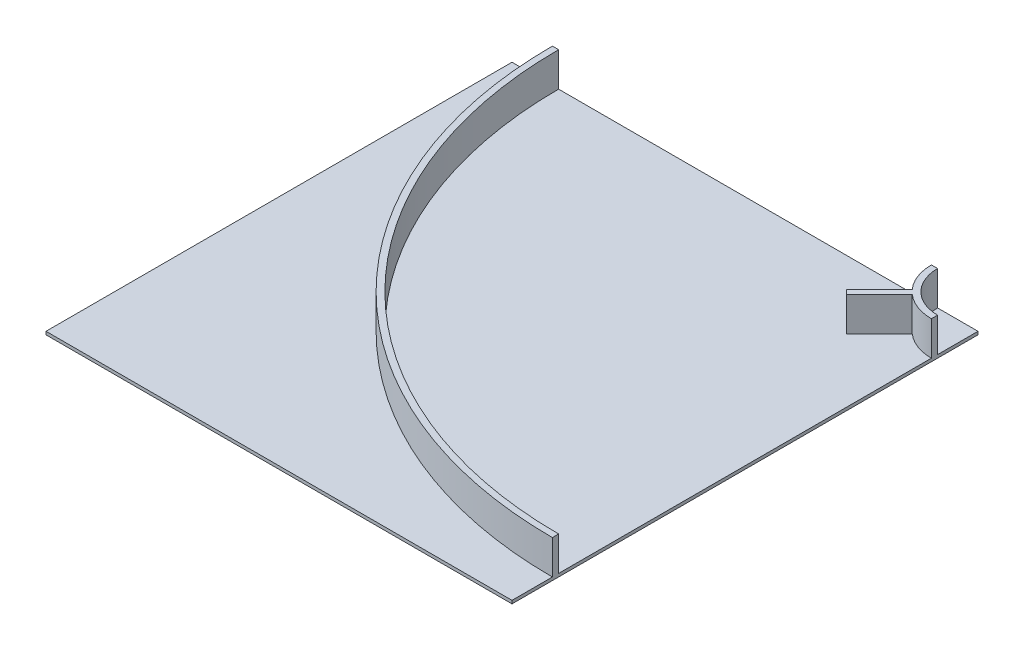
ISO-10303-21;
HEADER;
FILE_DESCRIPTION(('STEP AP214'),'2;1');
FILE_NAME('part.step','',(''),(''),'','','');
FILE_SCHEMA(('AUTOMOTIVE_DESIGN { 1 0 10303 214 1 1 1 1 }'));
ENDSEC;
DATA;
#1=APPLICATION_CONTEXT('core data for automotive mechanical design processes');
#2=APPLICATION_PROTOCOL_DEFINITION('international standard','automotive_design',2000,#1);
#3=PRODUCT_CONTEXT('',#1,'mechanical');
#4=PRODUCT('Part','Part','',(#3));
#5=PRODUCT_RELATED_PRODUCT_CATEGORY('part','',(#4));
#6=PRODUCT_DEFINITION_FORMATION('','',#4);
#7=PRODUCT_DEFINITION_CONTEXT('part definition',#1,'design');
#8=PRODUCT_DEFINITION('design','',#6,#7);
#9=PRODUCT_DEFINITION_SHAPE('','',#8);
#10=(LENGTH_UNIT() NAMED_UNIT(*) SI_UNIT(.MILLI.,.METRE.));
#11=(NAMED_UNIT(*) PLANE_ANGLE_UNIT() SI_UNIT($,.RADIAN.));
#12=(NAMED_UNIT(*) SI_UNIT($,.STERADIAN.) SOLID_ANGLE_UNIT());
#13=UNCERTAINTY_MEASURE_WITH_UNIT(LENGTH_MEASURE(1.E-05),#10,'distance_accuracy_value','');
#14=(GEOMETRIC_REPRESENTATION_CONTEXT(3) GLOBAL_UNCERTAINTY_ASSIGNED_CONTEXT((#13)) GLOBAL_UNIT_ASSIGNED_CONTEXT((#10,
#11,#12)) REPRESENTATION_CONTEXT('',''));
#15=CARTESIAN_POINT('',(0.,0.,0.));
#16=DIRECTION('',(0.,0.,1.));
#17=DIRECTION('',(1.,0.,0.));
#18=AXIS2_PLACEMENT_3D('',#15,#16,#17);
#19=CARTESIAN_POINT('',(0.,10.,0.));
#20=DIRECTION('',(0.,1.,0.));
#21=DIRECTION('',(0.,0.,1.));
#22=AXIS2_PLACEMENT_3D('',#19,#20,#21);
#23=PLANE('',#22);
#24=CARTESIAN_POINT('',(750.,10.,-750.));
#25=DIRECTION('',(0.,1.,0.));
#26=DIRECTION('',(0.,0.,1.));
#27=AXIS2_PLACEMENT_3D('',#24,#25,#26);
#28=CIRCLE('',#27,150.);
#29=CARTESIAN_POINT('',(651.241015369282,10.,-637.098879745551));
#30=VERTEX_POINT('',#29);
#31=CARTESIAN_POINT('',(750.,10.,-600.));
#32=VERTEX_POINT('',#31);
#33=EDGE_CURVE('E213',#30,#32,#28,.T.);
#34=ORIENTED_EDGE('',*,*,#33,.F.);
#35=DIRECTION('',(0.707106781186546,0.,-0.707106781186549));
#36=VECTOR('',#35,1.);
#37=CARTESIAN_POINT('',(545.1749981913,10.,-531.032862567569));
#38=LINE('',#37,#36);
#39=CARTESIAN_POINT('',(545.1749981913,10.,-531.032862567569));
#40=VERTEX_POINT('',#39);
#41=EDGE_CURVE('E352',#40,#30,#38,.T.);
#42=ORIENTED_EDGE('',*,*,#41,.F.);
#43=DIRECTION('',(0.707106781186547,0.,0.707106781186547));
#44=VECTOR('',#43,1.);
#45=CARTESIAN_POINT('',(545.1749981913,10.,-531.032862567569));
#46=LINE('',#45,#44);
#47=CARTESIAN_POINT('',(531.032862567568,10.,-545.1749981913));
#48=VERTEX_POINT('',#47);
#49=EDGE_CURVE('E364',#48,#40,#46,.T.);
#50=ORIENTED_EDGE('',*,*,#49,.F.);
#51=DIRECTION('',(-0.707106781186548,0.,0.707106781186547));
#52=VECTOR('',#51,1.);
#53=CARTESIAN_POINT('',(531.032862567568,10.,-545.1749981913));
#54=LINE('',#53,#52);
#55=CARTESIAN_POINT('',(637.098879745551,10.,-651.241015369282));
#56=VERTEX_POINT('',#55);
#57=EDGE_CURVE('E187',#56,#48,#54,.T.);
#58=ORIENTED_EDGE('',*,*,#57,.F.);
#59=CARTESIAN_POINT('',(600.,10.,-750.));
#60=VERTEX_POINT('',#59);
#61=EDGE_CURVE('E196',#60,#56,#28,.T.);
#62=ORIENTED_EDGE('',*,*,#61,.F.);
#63=DIRECTION('',(-1.,0.,0.));
#64=VECTOR('',#63,1.);
#65=CARTESIAN_POINT('',(-750.,10.,-750.));
#66=LINE('',#65,#64);
#67=CARTESIAN_POINT('',(-600.,10.,-750.));
#68=VERTEX_POINT('',#67);
#69=EDGE_CURVE('E269',#60,#68,#66,.T.);
#70=ORIENTED_EDGE('',*,*,#69,.T.);
#71=CARTESIAN_POINT('',(750.,10.,-750.));
#72=DIRECTION('',(0.,1.,0.));
#73=DIRECTION('',(0.,0.,1.));
#74=AXIS2_PLACEMENT_3D('',#71,#72,#73);
#75=CIRCLE('',#74,1350.);
#76=CARTESIAN_POINT('',(750.,10.,599.999999999999));
#77=VERTEX_POINT('',#76);
#78=EDGE_CURVE('E231',#68,#77,#75,.T.);
#79=ORIENTED_EDGE('',*,*,#78,.T.);
#80=DIRECTION('',(0.,0.,-1.));
#81=VECTOR('',#80,1.);
#82=CARTESIAN_POINT('',(750.,10.,-750.));
#83=LINE('',#82,#81);
#84=EDGE_CURVE('E279',#77,#32,#83,.T.);
#85=ORIENTED_EDGE('',*,*,#84,.T.);
#86=EDGE_LOOP('',(#34,#42,#50,#58,#62,#70,#79,#85));
#87=FACE_BOUND('',#86,.T.);
#88=ADVANCED_FACE('F62',(#87),#23,.T.);
#89=CARTESIAN_POINT('',(750.,120.,-750.));
#90=DIRECTION('',(0.,-1.,0.));
#91=DIRECTION('',(0.,0.,-1.));
#92=AXIS2_PLACEMENT_3D('',#89,#90,#91);
#93=CYLINDRICAL_SURFACE('',#92,150.);
#94=DIRECTION('',(0.,-1.,0.));
#95=VECTOR('',#94,1.);
#96=CARTESIAN_POINT('',(651.241015369282,290.,-637.098879745551));
#97=LINE('',#96,#95);
#98=CARTESIAN_POINT('',(651.241015369283,120.,-637.09887974555));
#99=VERTEX_POINT('',#98);
#100=EDGE_CURVE('E197',#99,#30,#97,.T.);
#101=ORIENTED_EDGE('',*,*,#100,.T.);
#102=ORIENTED_EDGE('',*,*,#33,.T.);
#103=DIRECTION('',(0.,-1.,0.));
#104=VECTOR('',#103,1.);
#105=CARTESIAN_POINT('',(750.,120.,-600.));
#106=LINE('',#105,#104);
#107=CARTESIAN_POINT('',(750.,120.,-600.));
#108=VERTEX_POINT('',#107);
#109=EDGE_CURVE('E218',#108,#32,#106,.T.);
#110=ORIENTED_EDGE('',*,*,#109,.F.);
#111=CARTESIAN_POINT('',(750.,120.,-750.));
#112=DIRECTION('',(0.,1.,0.));
#113=DIRECTION('',(0.,0.,1.));
#114=AXIS2_PLACEMENT_3D('',#111,#112,#113);
#115=CIRCLE('',#114,150.);
#116=EDGE_CURVE('E205',#99,#108,#115,.T.);
#117=ORIENTED_EDGE('',*,*,#116,.F.);
#118=EDGE_LOOP('',(#101,#102,#110,#117));
#119=FACE_BOUND('',#118,.T.);
#120=ADVANCED_FACE('F338',(#119),#93,.T.);
#121=DIRECTION('',(0.,-1.,0.));
#122=VECTOR('',#121,1.);
#123=CARTESIAN_POINT('',(637.098879745551,290.,-651.241015369282));
#124=LINE('',#123,#122);
#125=CARTESIAN_POINT('',(637.098879745551,120.,-651.241015369282));
#126=VERTEX_POINT('',#125);
#127=EDGE_CURVE('E181',#126,#56,#124,.T.);
#128=ORIENTED_EDGE('',*,*,#127,.F.);
#129=CARTESIAN_POINT('',(600.,120.,-750.));
#130=VERTEX_POINT('',#129);
#131=EDGE_CURVE('E194',#130,#126,#115,.T.);
#132=ORIENTED_EDGE('',*,*,#131,.F.);
#133=DIRECTION('',(0.,-1.,0.));
#134=VECTOR('',#133,1.);
#135=CARTESIAN_POINT('',(600.,120.,-750.));
#136=LINE('',#135,#134);
#137=EDGE_CURVE('E221',#130,#60,#136,.T.);
#138=ORIENTED_EDGE('',*,*,#137,.T.);
#139=ORIENTED_EDGE('',*,*,#61,.T.);
#140=EDGE_LOOP('',(#128,#132,#138,#139));
#141=FACE_BOUND('',#140,.T.);
#142=ADVANCED_FACE('F192',(#141),#93,.T.);
#143=CARTESIAN_POINT('',(750.,10.,-750.));
#144=DIRECTION('',(0.,1.,0.));
#145=DIRECTION('',(0.,0.,1.));
#146=AXIS2_PLACEMENT_3D('',#143,#144,#145);
#147=CIRCLE('',#146,130.);
#148=CARTESIAN_POINT('',(620.,10.,-750.));
#149=VERTEX_POINT('',#148);
#150=CARTESIAN_POINT('',(750.,10.,-620.));
#151=VERTEX_POINT('',#150);
#152=EDGE_CURVE('E88',#149,#151,#147,.T.);
#153=ORIENTED_EDGE('',*,*,#152,.T.);
#154=CARTESIAN_POINT('',(750.,10.,-750.));
#155=VERTEX_POINT('',#154);
#156=EDGE_CURVE('E66',#151,#155,#83,.T.);
#157=ORIENTED_EDGE('',*,*,#156,.T.);
#158=EDGE_CURVE('E270',#155,#149,#66,.T.);
#159=ORIENTED_EDGE('',*,*,#158,.T.);
#160=EDGE_LOOP('',(#153,#157,#159));
#161=FACE_BOUND('',#160,.T.);
#162=ADVANCED_FACE('F331',(#161),#23,.T.);
#163=CARTESIAN_POINT('',(750.,10.,-750.));
#164=DIRECTION('',(-1.,0.,0.));
#165=DIRECTION('',(0.,0.,1.));
#166=AXIS2_PLACEMENT_3D('',#163,#164,#165);
#167=PLANE('',#166);
#168=DIRECTION('',(0.,0.,-1.));
#169=VECTOR('',#168,1.);
#170=CARTESIAN_POINT('',(750.,0.,-750.));
#171=LINE('',#170,#169);
#172=CARTESIAN_POINT('',(750.,0.,750.));
#173=VERTEX_POINT('',#172);
#174=CARTESIAN_POINT('',(750.,0.,-750.));
#175=VERTEX_POINT('',#174);
#176=EDGE_CURVE('E258',#173,#175,#171,.T.);
#177=ORIENTED_EDGE('',*,*,#176,.T.);
#178=DIRECTION('',(0.,-1.,0.));
#179=VECTOR('',#178,1.);
#180=CARTESIAN_POINT('',(750.,10.,-750.));
#181=LINE('',#180,#179);
#182=EDGE_CURVE('E12',#155,#175,#181,.T.);
#183=ORIENTED_EDGE('',*,*,#182,.F.);
#184=ORIENTED_EDGE('',*,*,#156,.F.);
#185=DIRECTION('',(0.,-1.,0.));
#186=VECTOR('',#185,1.);
#187=CARTESIAN_POINT('',(750.,120.,-620.));
#188=LINE('',#187,#186);
#189=CARTESIAN_POINT('',(750.,120.,-620.));
#190=VERTEX_POINT('',#189);
#191=EDGE_CURVE('E207',#190,#151,#188,.T.);
#192=ORIENTED_EDGE('',*,*,#191,.F.);
#193=DIRECTION('',(0.,0.,-1.));
#194=VECTOR('',#193,1.);
#195=CARTESIAN_POINT('',(750.,120.,-1.11022302462516E-13));
#196=LINE('',#195,#194);
#197=EDGE_CURVE('E204',#108,#190,#196,.T.);
#198=ORIENTED_EDGE('',*,*,#197,.F.);
#199=ORIENTED_EDGE('',*,*,#109,.T.);
#200=ORIENTED_EDGE('',*,*,#84,.F.);
#201=DIRECTION('',(0.,-1.,0.));
#202=VECTOR('',#201,1.);
#203=CARTESIAN_POINT('',(750.,120.,599.999999999999));
#204=LINE('',#203,#202);
#205=CARTESIAN_POINT('',(750.,120.,599.999999999999));
#206=VERTEX_POINT('',#205);
#207=EDGE_CURVE('E253',#206,#77,#204,.T.);
#208=ORIENTED_EDGE('',*,*,#207,.F.);
#209=DIRECTION('',(0.,0.,-1.));
#210=VECTOR('',#209,1.);
#211=CARTESIAN_POINT('',(750.,120.,-1.11022302462516E-13));
#212=LINE('',#211,#210);
#213=CARTESIAN_POINT('',(750.,120.,620.));
#214=VERTEX_POINT('',#213);
#215=EDGE_CURVE('E233',#214,#206,#212,.T.);
#216=ORIENTED_EDGE('',*,*,#215,.F.);
#217=DIRECTION('',(0.,-1.,0.));
#218=VECTOR('',#217,1.);
#219=CARTESIAN_POINT('',(750.,120.,620.));
#220=LINE('',#219,#218);
#221=CARTESIAN_POINT('',(750.,10.,620.));
#222=VERTEX_POINT('',#221);
#223=EDGE_CURVE('E249',#214,#222,#220,.T.);
#224=ORIENTED_EDGE('',*,*,#223,.T.);
#225=CARTESIAN_POINT('',(750.,10.,750.));
#226=VERTEX_POINT('',#225);
#227=EDGE_CURVE('E282',#226,#222,#83,.T.);
#228=ORIENTED_EDGE('',*,*,#227,.F.);
#229=DIRECTION('',(0.,-1.,0.));
#230=VECTOR('',#229,1.);
#231=CARTESIAN_POINT('',(750.,10.,750.));
#232=LINE('',#231,#230);
#233=EDGE_CURVE('E289',#226,#173,#232,.T.);
#234=ORIENTED_EDGE('',*,*,#233,.T.);
#235=EDGE_LOOP('',(#177,#183,#184,#192,#198,#199,#200,#208,#216,#224,#228,#234));
#236=FACE_BOUND('',#235,.T.);
#237=ADVANCED_FACE('F64',(#236),#167,.F.);
#238=CARTESIAN_POINT('',(-750.,10.,-750.));
#239=DIRECTION('',(0.,0.,1.));
#240=DIRECTION('',(1.,0.,0.));
#241=AXIS2_PLACEMENT_3D('',#238,#239,#240);
#242=PLANE('',#241);
#243=DIRECTION('',(-1.,0.,0.));
#244=VECTOR('',#243,1.);
#245=CARTESIAN_POINT('',(-750.,0.,-750.));
#246=LINE('',#245,#244);
#247=CARTESIAN_POINT('',(-750.,0.,-750.));
#248=VERTEX_POINT('',#247);
#249=EDGE_CURVE('E297',#175,#248,#246,.T.);
#250=ORIENTED_EDGE('',*,*,#249,.T.);
#251=DIRECTION('',(0.,-1.,0.));
#252=VECTOR('',#251,1.);
#253=CARTESIAN_POINT('',(-750.,10.,-750.));
#254=LINE('',#253,#252);
#255=CARTESIAN_POINT('',(-750.,10.,-750.));
#256=VERTEX_POINT('',#255);
#257=EDGE_CURVE('E72',#256,#248,#254,.T.);
#258=ORIENTED_EDGE('',*,*,#257,.F.);
#259=CARTESIAN_POINT('',(-620.,10.,-750.));
#260=VERTEX_POINT('',#259);
#261=EDGE_CURVE('E246',#260,#256,#66,.T.);
#262=ORIENTED_EDGE('',*,*,#261,.F.);
#263=DIRECTION('',(0.,-1.,0.));
#264=VECTOR('',#263,1.);
#265=CARTESIAN_POINT('',(-620.,120.,-750.));
#266=LINE('',#265,#264);
#267=CARTESIAN_POINT('',(-620.,120.,-750.));
#268=VERTEX_POINT('',#267);
#269=EDGE_CURVE('E252',#268,#260,#266,.T.);
#270=ORIENTED_EDGE('',*,*,#269,.F.);
#271=DIRECTION('',(-1.,0.,0.));
#272=VECTOR('',#271,1.);
#273=CARTESIAN_POINT('',(0.,120.,-750.));
#274=LINE('',#273,#272);
#275=CARTESIAN_POINT('',(-600.,120.,-750.));
#276=VERTEX_POINT('',#275);
#277=EDGE_CURVE('E227',#276,#268,#274,.T.);
#278=ORIENTED_EDGE('',*,*,#277,.F.);
#279=DIRECTION('',(0.,-1.,0.));
#280=VECTOR('',#279,1.);
#281=CARTESIAN_POINT('',(-600.,120.,-750.));
#282=LINE('',#281,#280);
#283=EDGE_CURVE('E238',#276,#68,#282,.T.);
#284=ORIENTED_EDGE('',*,*,#283,.T.);
#285=ORIENTED_EDGE('',*,*,#69,.F.);
#286=ORIENTED_EDGE('',*,*,#137,.F.);
#287=DIRECTION('',(-1.,0.,0.));
#288=VECTOR('',#287,1.);
#289=CARTESIAN_POINT('',(0.,120.,-750.));
#290=LINE('',#289,#288);
#291=CARTESIAN_POINT('',(620.,120.,-750.));
#292=VERTEX_POINT('',#291);
#293=EDGE_CURVE('E202',#292,#130,#290,.T.);
#294=ORIENTED_EDGE('',*,*,#293,.F.);
#295=DIRECTION('',(0.,-1.,0.));
#296=VECTOR('',#295,1.);
#297=CARTESIAN_POINT('',(620.,120.,-750.));
#298=LINE('',#297,#296);
#299=EDGE_CURVE('E223',#292,#149,#298,.T.);
#300=ORIENTED_EDGE('',*,*,#299,.T.);
#301=ORIENTED_EDGE('',*,*,#158,.F.);
#302=ORIENTED_EDGE('',*,*,#182,.T.);
#303=EDGE_LOOP('',(#250,#258,#262,#270,#278,#284,#285,#286,#294,#300,#301,#302));
#304=FACE_BOUND('',#303,.T.);
#305=ADVANCED_FACE('F324',(#304),#242,.F.);
#306=CARTESIAN_POINT('',(-750.,10.,-750.));
#307=DIRECTION('',(1.,0.,0.));
#308=DIRECTION('',(0.,0.,-1.));
#309=AXIS2_PLACEMENT_3D('',#306,#307,#308);
#310=PLANE('',#309);
#311=DIRECTION('',(0.,0.,1.));
#312=VECTOR('',#311,1.);
#313=CARTESIAN_POINT('',(-750.,0.,-750.));
#314=LINE('',#313,#312);
#315=CARTESIAN_POINT('',(-750.,0.,750.));
#316=VERTEX_POINT('',#315);
#317=EDGE_CURVE('E295',#248,#316,#314,.T.);
#318=ORIENTED_EDGE('',*,*,#317,.T.);
#319=DIRECTION('',(0.,-1.,0.));
#320=VECTOR('',#319,1.);
#321=CARTESIAN_POINT('',(-750.,10.,750.));
#322=LINE('',#321,#320);
#323=CARTESIAN_POINT('',(-750.,10.,750.));
#324=VERTEX_POINT('',#323);
#325=EDGE_CURVE('E286',#324,#316,#322,.T.);
#326=ORIENTED_EDGE('',*,*,#325,.F.);
#327=DIRECTION('',(0.,0.,1.));
#328=VECTOR('',#327,1.);
#329=CARTESIAN_POINT('',(-750.,10.,-750.));
#330=LINE('',#329,#328);
#331=EDGE_CURVE('E274',#256,#324,#330,.T.);
#332=ORIENTED_EDGE('',*,*,#331,.F.);
#333=ORIENTED_EDGE('',*,*,#257,.T.);
#334=EDGE_LOOP('',(#318,#326,#332,#333));
#335=FACE_BOUND('',#334,.T.);
#336=ADVANCED_FACE('F309',(#335),#310,.F.);
#337=CARTESIAN_POINT('',(-750.,10.,750.));
#338=DIRECTION('',(0.,0.,-1.));
#339=DIRECTION('',(-1.,0.,0.));
#340=AXIS2_PLACEMENT_3D('',#337,#338,#339);
#341=PLANE('',#340);
#342=DIRECTION('',(1.,0.,0.));
#343=VECTOR('',#342,1.);
#344=CARTESIAN_POINT('',(-750.,0.,750.));
#345=LINE('',#344,#343);
#346=EDGE_CURVE('E293',#316,#173,#345,.T.);
#347=ORIENTED_EDGE('',*,*,#346,.T.);
#348=ORIENTED_EDGE('',*,*,#233,.F.);
#349=DIRECTION('',(1.,0.,0.));
#350=VECTOR('',#349,1.);
#351=CARTESIAN_POINT('',(-750.,10.,750.));
#352=LINE('',#351,#350);
#353=EDGE_CURVE('E292',#324,#226,#352,.T.);
#354=ORIENTED_EDGE('',*,*,#353,.F.);
#355=ORIENTED_EDGE('',*,*,#325,.T.);
#356=EDGE_LOOP('',(#347,#348,#354,#355));
#357=FACE_BOUND('',#356,.T.);
#358=ADVANCED_FACE('F313',(#357),#341,.F.);
#359=CARTESIAN_POINT('',(750.,10.,-750.));
#360=DIRECTION('',(0.,1.,0.));
#361=DIRECTION('',(0.,0.,1.));
#362=AXIS2_PLACEMENT_3D('',#359,#360,#361);
#363=CIRCLE('',#362,1370.);
#364=EDGE_CURVE('E226',#260,#222,#363,.T.);
#365=ORIENTED_EDGE('',*,*,#364,.F.);
#366=ORIENTED_EDGE('',*,*,#261,.T.);
#367=ORIENTED_EDGE('',*,*,#331,.T.);
#368=ORIENTED_EDGE('',*,*,#353,.T.);
#369=ORIENTED_EDGE('',*,*,#227,.T.);
#370=EDGE_LOOP('',(#365,#366,#367,#368,#369));
#371=FACE_BOUND('',#370,.T.);
#372=ADVANCED_FACE('F305',(#371),#23,.T.);
#373=CARTESIAN_POINT('',(0.,0.,0.));
#374=DIRECTION('',(0.,1.,0.));
#375=DIRECTION('',(0.,0.,1.));
#376=AXIS2_PLACEMENT_3D('',#373,#374,#375);
#377=PLANE('',#376);
#378=ORIENTED_EDGE('',*,*,#176,.F.);
#379=ORIENTED_EDGE('',*,*,#346,.F.);
#380=ORIENTED_EDGE('',*,*,#317,.F.);
#381=ORIENTED_EDGE('',*,*,#249,.F.);
#382=EDGE_LOOP('',(#378,#379,#380,#381));
#383=FACE_BOUND('',#382,.T.);
#384=ADVANCED_FACE('F327',(#383),#377,.F.);
#385=CARTESIAN_POINT('',(750.,120.,-750.));
#386=DIRECTION('',(0.,-1.,0.));
#387=DIRECTION('',(0.,0.,-1.));
#388=AXIS2_PLACEMENT_3D('',#385,#386,#387);
#389=CYLINDRICAL_SURFACE('',#388,1370.);
#390=ORIENTED_EDGE('',*,*,#364,.T.);
#391=ORIENTED_EDGE('',*,*,#223,.F.);
#392=CARTESIAN_POINT('',(750.,120.,-750.));
#393=DIRECTION('',(0.,1.,0.));
#394=DIRECTION('',(0.,0.,1.));
#395=AXIS2_PLACEMENT_3D('',#392,#393,#394);
#396=CIRCLE('',#395,1370.);
#397=EDGE_CURVE('E230',#268,#214,#396,.T.);
#398=ORIENTED_EDGE('',*,*,#397,.F.);
#399=ORIENTED_EDGE('',*,*,#269,.T.);
#400=EDGE_LOOP('',(#390,#391,#398,#399));
#401=FACE_BOUND('',#400,.T.);
#402=ADVANCED_FACE('F320',(#401),#389,.T.);
#403=CARTESIAN_POINT('',(750.,120.,-750.));
#404=DIRECTION('',(0.,-1.,0.));
#405=DIRECTION('',(0.,0.,-1.));
#406=AXIS2_PLACEMENT_3D('',#403,#404,#405);
#407=CYLINDRICAL_SURFACE('',#406,1350.);
#408=ORIENTED_EDGE('',*,*,#78,.F.);
#409=ORIENTED_EDGE('',*,*,#283,.F.);
#410=CARTESIAN_POINT('',(750.,120.,-750.));
#411=DIRECTION('',(0.,1.,0.));
#412=DIRECTION('',(0.,0.,1.));
#413=AXIS2_PLACEMENT_3D('',#410,#411,#412);
#414=CIRCLE('',#413,1350.);
#415=EDGE_CURVE('E235',#276,#206,#414,.T.);
#416=ORIENTED_EDGE('',*,*,#415,.T.);
#417=ORIENTED_EDGE('',*,*,#207,.T.);
#418=EDGE_LOOP('',(#408,#409,#416,#417));
#419=FACE_BOUND('',#418,.T.);
#420=ADVANCED_FACE('F371',(#419),#407,.F.);
#421=CARTESIAN_POINT('',(0.,120.,0.));
#422=DIRECTION('',(0.,1.,0.));
#423=DIRECTION('',(0.,0.,1.));
#424=AXIS2_PLACEMENT_3D('',#421,#422,#423);
#425=PLANE('',#424);
#426=ORIENTED_EDGE('',*,*,#277,.T.);
#427=ORIENTED_EDGE('',*,*,#397,.T.);
#428=ORIENTED_EDGE('',*,*,#215,.T.);
#429=ORIENTED_EDGE('',*,*,#415,.F.);
#430=EDGE_LOOP('',(#426,#427,#428,#429));
#431=FACE_BOUND('',#430,.T.);
#432=ADVANCED_FACE('F373',(#431),#425,.T.);
#433=CARTESIAN_POINT('',(750.,120.,-750.));
#434=DIRECTION('',(0.,-1.,0.));
#435=DIRECTION('',(0.,0.,-1.));
#436=AXIS2_PLACEMENT_3D('',#433,#434,#435);
#437=CYLINDRICAL_SURFACE('',#436,130.);
#438=ORIENTED_EDGE('',*,*,#152,.F.);
#439=ORIENTED_EDGE('',*,*,#299,.F.);
#440=CARTESIAN_POINT('',(750.,120.,-750.));
#441=DIRECTION('',(0.,1.,0.));
#442=DIRECTION('',(0.,0.,1.));
#443=AXIS2_PLACEMENT_3D('',#440,#441,#442);
#444=CIRCLE('',#443,130.);
#445=EDGE_CURVE('E215',#292,#190,#444,.T.);
#446=ORIENTED_EDGE('',*,*,#445,.T.);
#447=ORIENTED_EDGE('',*,*,#191,.T.);
#448=EDGE_LOOP('',(#438,#439,#446,#447));
#449=FACE_BOUND('',#448,.T.);
#450=ADVANCED_FACE('F367',(#449),#437,.F.);
#451=CARTESIAN_POINT('',(0.,120.,0.));
#452=DIRECTION('',(0.,1.,0.));
#453=DIRECTION('',(0.,0.,1.));
#454=AXIS2_PLACEMENT_3D('',#451,#452,#453);
#455=PLANE('',#454);
#456=ORIENTED_EDGE('',*,*,#131,.T.);
#457=DIRECTION('',(-0.707106781186548,0.,0.707106781186547));
#458=VECTOR('',#457,1.);
#459=CARTESIAN_POINT('',(531.032862567568,120.,-545.1749981913));
#460=LINE('',#459,#458);
#461=CARTESIAN_POINT('',(531.032862567568,120.,-545.1749981913));
#462=VERTEX_POINT('',#461);
#463=EDGE_CURVE('E177',#126,#462,#460,.T.);
#464=ORIENTED_EDGE('',*,*,#463,.T.);
#465=DIRECTION('',(0.707106781186548,0.,0.707106781186548));
#466=VECTOR('',#465,1.);
#467=CARTESIAN_POINT('',(545.1749981913,120.,-531.032862567569));
#468=LINE('',#467,#466);
#469=CARTESIAN_POINT('',(545.1749981913,120.,-531.032862567569));
#470=VERTEX_POINT('',#469);
#471=EDGE_CURVE('E186',#462,#470,#468,.T.);
#472=ORIENTED_EDGE('',*,*,#471,.T.);
#473=DIRECTION('',(0.707106781186546,0.,-0.707106781186549));
#474=VECTOR('',#473,1.);
#475=CARTESIAN_POINT('',(545.1749981913,120.,-531.032862567569));
#476=LINE('',#475,#474);
#477=EDGE_CURVE('E80',#470,#99,#476,.T.);
#478=ORIENTED_EDGE('',*,*,#477,.T.);
#479=ORIENTED_EDGE('',*,*,#116,.T.);
#480=ORIENTED_EDGE('',*,*,#197,.T.);
#481=ORIENTED_EDGE('',*,*,#445,.F.);
#482=ORIENTED_EDGE('',*,*,#293,.T.);
#483=EDGE_LOOP('',(#456,#464,#472,#478,#479,#480,#481,#482));
#484=FACE_BOUND('',#483,.T.);
#485=ADVANCED_FACE('F199',(#484),#455,.T.);
#486=CARTESIAN_POINT('',(545.1749981913,290.,-531.032862567569));
#487=DIRECTION('',(0.707106781186547,0.,-0.707106781186547));
#488=DIRECTION('',(-0.707106781186548,0.,-0.707106781186548));
#489=AXIS2_PLACEMENT_3D('',#486,#487,#488);
#490=PLANE('',#489);
#491=ORIENTED_EDGE('',*,*,#471,.F.);
#492=DIRECTION('',(0.,-1.,0.));
#493=VECTOR('',#492,1.);
#494=CARTESIAN_POINT('',(531.032862567568,290.,-545.1749981913));
#495=LINE('',#494,#493);
#496=EDGE_CURVE('E183',#462,#48,#495,.T.);
#497=ORIENTED_EDGE('',*,*,#496,.T.);
#498=ORIENTED_EDGE('',*,*,#49,.T.);
#499=DIRECTION('',(0.,-1.,0.));
#500=VECTOR('',#499,1.);
#501=CARTESIAN_POINT('',(545.1749981913,290.,-531.032862567569));
#502=LINE('',#501,#500);
#503=EDGE_CURVE('E360',#470,#40,#502,.T.);
#504=ORIENTED_EDGE('',*,*,#503,.F.);
#505=EDGE_LOOP('',(#491,#497,#498,#504));
#506=FACE_BOUND('',#505,.T.);
#507=ADVANCED_FACE('F458',(#506),#490,.F.);
#508=CARTESIAN_POINT('',(545.1749981913,290.,-531.032862567569));
#509=DIRECTION('',(-0.707106781186549,0.,-0.707106781186546));
#510=DIRECTION('',(-0.707106781186546,0.,0.707106781186549));
#511=AXIS2_PLACEMENT_3D('',#508,#509,#510);
#512=PLANE('',#511);
#513=ORIENTED_EDGE('',*,*,#477,.F.);
#514=ORIENTED_EDGE('',*,*,#503,.T.);
#515=ORIENTED_EDGE('',*,*,#41,.T.);
#516=ORIENTED_EDGE('',*,*,#100,.F.);
#517=EDGE_LOOP('',(#513,#514,#515,#516));
#518=FACE_BOUND('',#517,.T.);
#519=ADVANCED_FACE('F467',(#518),#512,.F.);
#520=CARTESIAN_POINT('',(531.032862567568,290.,-545.1749981913));
#521=DIRECTION('',(0.707106781186547,0.,0.707106781186548));
#522=DIRECTION('',(0.707106781186548,0.,-0.707106781186547));
#523=AXIS2_PLACEMENT_3D('',#520,#521,#522);
#524=PLANE('',#523);
#525=ORIENTED_EDGE('',*,*,#463,.F.);
#526=ORIENTED_EDGE('',*,*,#127,.T.);
#527=ORIENTED_EDGE('',*,*,#57,.T.);
#528=ORIENTED_EDGE('',*,*,#496,.F.);
#529=EDGE_LOOP('',(#525,#526,#527,#528));
#530=FACE_BOUND('',#529,.T.);
#531=ADVANCED_FACE('F179',(#530),#524,.F.);
#532=CLOSED_SHELL('',(#88,#120,#142,#162,#237,#305,#336,#358,#372,#384,#402,#420,#432,#450,#485,
#507,#519,#531));
#533=MANIFOLD_SOLID_BREP('B2',#532);
#534=ADVANCED_BREP_SHAPE_REPRESENTATION('',(#18,#533),#14);
#535=SHAPE_DEFINITION_REPRESENTATION(#9,#534);
ENDSEC;
END-ISO-10303-21;
